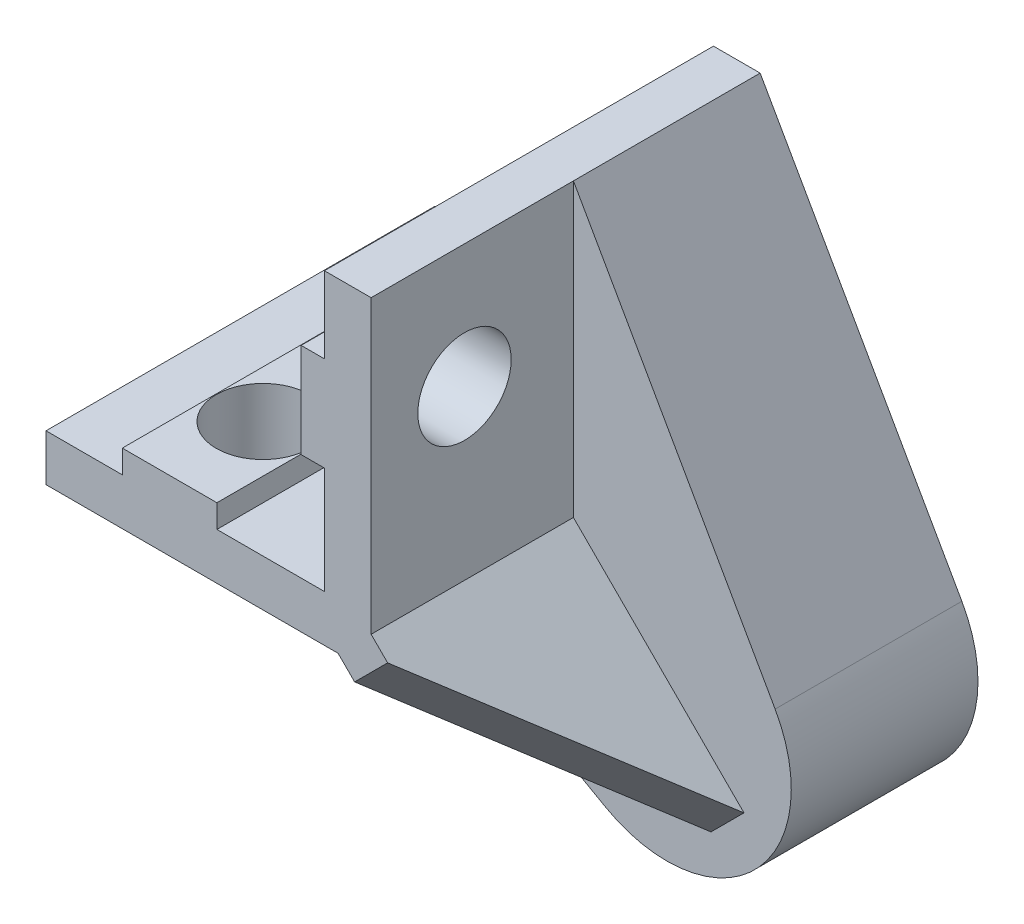
ISO-10303-21;
HEADER;
FILE_DESCRIPTION(('STEP AP214'),'2;1');
FILE_NAME('part.step','',(''),(''),'','','');
FILE_SCHEMA(('AUTOMOTIVE_DESIGN { 1 0 10303 214 1 1 1 1 }'));
ENDSEC;
DATA;
#1=APPLICATION_CONTEXT('core data for automotive mechanical design processes');
#2=APPLICATION_PROTOCOL_DEFINITION('international standard','automotive_design',2000,#1);
#3=PRODUCT_CONTEXT('',#1,'mechanical');
#4=PRODUCT('Part','Part','',(#3));
#5=PRODUCT_RELATED_PRODUCT_CATEGORY('part','',(#4));
#6=PRODUCT_DEFINITION_FORMATION('','',#4);
#7=PRODUCT_DEFINITION_CONTEXT('part definition',#1,'design');
#8=PRODUCT_DEFINITION('design','',#6,#7);
#9=PRODUCT_DEFINITION_SHAPE('','',#8);
#10=(LENGTH_UNIT() NAMED_UNIT(*) SI_UNIT(.MILLI.,.METRE.));
#11=(NAMED_UNIT(*) PLANE_ANGLE_UNIT() SI_UNIT($,.RADIAN.));
#12=(NAMED_UNIT(*) SI_UNIT($,.STERADIAN.) SOLID_ANGLE_UNIT());
#13=UNCERTAINTY_MEASURE_WITH_UNIT(LENGTH_MEASURE(1.E-05),#10,'distance_accuracy_value','');
#14=(GEOMETRIC_REPRESENTATION_CONTEXT(3) GLOBAL_UNCERTAINTY_ASSIGNED_CONTEXT((#13)) GLOBAL_UNIT_ASSIGNED_CONTEXT((#10,
#11,#12)) REPRESENTATION_CONTEXT('',''));
#15=CARTESIAN_POINT('',(0.,0.,0.));
#16=DIRECTION('',(0.,0.,1.));
#17=DIRECTION('',(1.,0.,0.));
#18=AXIS2_PLACEMENT_3D('',#15,#16,#17);
#19=CARTESIAN_POINT('',(230.088719843331,41.429550862018,-25.));
#20=DIRECTION('',(1.,0.,0.));
#21=DIRECTION('',(0.,0.,-1.));
#22=AXIS2_PLACEMENT_3D('',#19,#20,#21);
#23=PLANE('',#22);
#24=CARTESIAN_POINT('',(230.088719843331,54.3395711724228,-6.));
#25=DIRECTION('',(1.,0.,0.));
#26=DIRECTION('',(0.,0.,-1.));
#27=AXIS2_PLACEMENT_3D('',#24,#25,#26);
#28=CIRCLE('',#27,3.);
#29=CARTESIAN_POINT('',(230.088719843331,54.3395711724228,-9.));
#30=VERTEX_POINT('',#29);
#31=EDGE_CURVE('E244',#30,#30,#28,.T.);
#32=ORIENTED_EDGE('',*,*,#31,.F.);
#33=EDGE_LOOP('',(#32));
#34=FACE_BOUND('',#33,.T.);
#35=DIRECTION('',(0.,1.,0.));
#36=VECTOR('',#35,1.);
#37=CARTESIAN_POINT('',(230.088719843331,41.429550862018,0.));
#38=LINE('',#37,#36);
#39=CARTESIAN_POINT('',(230.088719843331,43.5504865618595,0.));
#40=VERTEX_POINT('',#39);
#41=CARTESIAN_POINT('',(230.088719843331,62.2829711724228,0.));
#42=VERTEX_POINT('',#41);
#43=EDGE_CURVE('E51',#40,#42,#38,.T.);
#44=ORIENTED_EDGE('',*,*,#43,.F.);
#45=DIRECTION('',(0.,0.,-1.));
#46=VECTOR('',#45,1.);
#47=CARTESIAN_POINT('',(230.088719843331,43.5504865618595,-25.));
#48=LINE('',#47,#46);
#49=CARTESIAN_POINT('',(230.088719843331,43.5504865618595,-13.));
#50=VERTEX_POINT('',#49);
#51=EDGE_CURVE('E210',#40,#50,#48,.T.);
#52=ORIENTED_EDGE('',*,*,#51,.T.);
#53=DIRECTION('',(0.,1.,0.));
#54=VECTOR('',#53,1.);
#55=CARTESIAN_POINT('',(230.088719843331,41.429550862018,-13.));
#56=LINE('',#55,#54);
#57=CARTESIAN_POINT('',(230.088719843331,62.2829711724228,-13.));
#58=VERTEX_POINT('',#57);
#59=EDGE_CURVE('E214',#50,#58,#56,.T.);
#60=ORIENTED_EDGE('',*,*,#59,.T.);
#61=DIRECTION('',(0.,0.,1.));
#62=VECTOR('',#61,1.);
#63=CARTESIAN_POINT('',(230.088719843331,62.2829711724228,-25.));
#64=LINE('',#63,#62);
#65=EDGE_CURVE('E326',#58,#42,#64,.T.);
#66=ORIENTED_EDGE('',*,*,#65,.T.);
#67=EDGE_LOOP('',(#44,#52,#60,#66));
#68=FACE_BOUND('',#67,.T.);
#69=ADVANCED_FACE('F36',(#34,#68),#23,.T.);
#70=CARTESIAN_POINT('',(209.195275179556,41.429550862018,-25.));
#71=DIRECTION('',(0.,-1.,0.));
#72=DIRECTION('',(0.,0.,-1.));
#73=AXIS2_PLACEMENT_3D('',#70,#71,#72);
#74=PLANE('',#73);
#75=DIRECTION('',(0.,0.,-1.));
#76=VECTOR('',#75,1.);
#77=CARTESIAN_POINT('',(227.967014646705,41.429550862018,-25.));
#78=LINE('',#77,#76);
#79=CARTESIAN_POINT('',(227.967014646705,41.429550862018,0.));
#80=VERTEX_POINT('',#79);
#81=CARTESIAN_POINT('',(227.967014646705,41.429550862018,-13.));
#82=VERTEX_POINT('',#81);
#83=EDGE_CURVE('E59',#80,#82,#78,.T.);
#84=ORIENTED_EDGE('',*,*,#83,.F.);
#85=DIRECTION('',(1.,0.,0.));
#86=VECTOR('',#85,1.);
#87=CARTESIAN_POINT('',(209.195275179556,41.429550862018,0.));
#88=LINE('',#87,#86);
#89=CARTESIAN_POINT('',(209.195275179556,41.429550862018,0.));
#90=VERTEX_POINT('',#89);
#91=EDGE_CURVE('E199',#90,#80,#88,.T.);
#92=ORIENTED_EDGE('',*,*,#91,.F.);
#93=DIRECTION('',(0.,0.,1.));
#94=VECTOR('',#93,1.);
#95=CARTESIAN_POINT('',(209.195275179556,41.429550862018,-25.));
#96=LINE('',#95,#94);
#97=CARTESIAN_POINT('',(209.195275179556,41.429550862018,-13.));
#98=VERTEX_POINT('',#97);
#99=EDGE_CURVE('E330',#98,#90,#96,.T.);
#100=ORIENTED_EDGE('',*,*,#99,.F.);
#101=DIRECTION('',(1.,0.,0.));
#102=VECTOR('',#101,1.);
#103=CARTESIAN_POINT('',(209.195275179556,41.429550862018,-13.));
#104=LINE('',#103,#102);
#105=EDGE_CURVE('E226',#98,#82,#104,.T.);
#106=ORIENTED_EDGE('',*,*,#105,.T.);
#107=EDGE_LOOP('',(#84,#92,#100,#106));
#108=FACE_BOUND('',#107,.T.);
#109=CARTESIAN_POINT('',(217.138695007103,41.429550862018,-6.));
#110=DIRECTION('',(0.,-1.,0.));
#111=DIRECTION('',(0.,0.,-1.));
#112=AXIS2_PLACEMENT_3D('',#109,#110,#111);
#113=CIRCLE('',#112,2.99999999999999);
#114=CARTESIAN_POINT('',(217.138695007103,41.429550862018,-8.99999999999999));
#115=VERTEX_POINT('',#114);
#116=EDGE_CURVE('E239',#115,#115,#113,.T.);
#117=ORIENTED_EDGE('',*,*,#116,.F.);
#118=EDGE_LOOP('',(#117));
#119=FACE_BOUND('',#118,.T.);
#120=ADVANCED_FACE('F365',(#108,#119),#74,.T.);
#121=CARTESIAN_POINT('',(230.088719843331,62.2829711724228,-25.));
#122=DIRECTION('',(0.,1.,0.));
#123=DIRECTION('',(-1.,0.,0.));
#124=AXIS2_PLACEMENT_3D('',#121,#122,#123);
#125=PLANE('',#124);
#126=DIRECTION('',(-1.,0.,0.));
#127=VECTOR('',#126,1.);
#128=CARTESIAN_POINT('',(230.088719843331,62.2829711724228,0.));
#129=LINE('',#128,#127);
#130=CARTESIAN_POINT('',(227.088719843331,62.2829711724228,0.));
#131=VERTEX_POINT('',#130);
#132=EDGE_CURVE('E286',#42,#131,#129,.T.);
#133=ORIENTED_EDGE('',*,*,#132,.F.);
#134=ORIENTED_EDGE('',*,*,#65,.F.);
#135=CARTESIAN_POINT('',(230.088719843331,62.2829711724228,-25.));
#136=VERTEX_POINT('',#135);
#137=EDGE_CURVE('E322',#136,#58,#64,.T.);
#138=ORIENTED_EDGE('',*,*,#137,.F.);
#139=DIRECTION('',(-1.,0.,0.));
#140=VECTOR('',#139,1.);
#141=CARTESIAN_POINT('',(230.088719843331,62.2829711724228,-25.));
#142=LINE('',#141,#140);
#143=CARTESIAN_POINT('',(227.088719843331,62.2829711724228,-25.));
#144=VERTEX_POINT('',#143);
#145=EDGE_CURVE('E248',#136,#144,#142,.T.);
#146=ORIENTED_EDGE('',*,*,#145,.T.);
#147=DIRECTION('',(0.,0.,1.));
#148=VECTOR('',#147,1.);
#149=CARTESIAN_POINT('',(227.088719843331,62.2829711724228,-25.));
#150=LINE('',#149,#148);
#151=EDGE_CURVE('E285',#144,#131,#150,.T.);
#152=ORIENTED_EDGE('',*,*,#151,.T.);
#153=EDGE_LOOP('',(#133,#134,#138,#146,#152));
#154=FACE_BOUND('',#153,.T.);
#155=ADVANCED_FACE('F38',(#154),#125,.T.);
#156=CARTESIAN_POINT('',(209.195275179556,44.429550862018,-25.));
#157=DIRECTION('',(-1.,0.,0.));
#158=DIRECTION('',(0.,-1.,0.));
#159=AXIS2_PLACEMENT_3D('',#156,#157,#158);
#160=PLANE('',#159);
#161=DIRECTION('',(0.,-1.,0.));
#162=VECTOR('',#161,1.);
#163=CARTESIAN_POINT('',(209.195275179556,44.429550862018,0.));
#164=LINE('',#163,#162);
#165=CARTESIAN_POINT('',(209.195275179556,44.429550862018,0.));
#166=VERTEX_POINT('',#165);
#167=EDGE_CURVE('E318',#166,#90,#164,.T.);
#168=ORIENTED_EDGE('',*,*,#167,.F.);
#169=DIRECTION('',(0.,0.,1.));
#170=VECTOR('',#169,1.);
#171=CARTESIAN_POINT('',(209.195275179556,44.429550862018,-25.));
#172=LINE('',#171,#170);
#173=CARTESIAN_POINT('',(209.195275179556,44.429550862018,-25.));
#174=VERTEX_POINT('',#173);
#175=EDGE_CURVE('E331',#174,#166,#172,.T.);
#176=ORIENTED_EDGE('',*,*,#175,.F.);
#177=DIRECTION('',(0.,-1.,0.));
#178=VECTOR('',#177,1.);
#179=CARTESIAN_POINT('',(209.195275179556,44.429550862018,-25.));
#180=LINE('',#179,#178);
#181=CARTESIAN_POINT('',(209.195275179556,41.429550862018,-25.));
#182=VERTEX_POINT('',#181);
#183=EDGE_CURVE('E283',#174,#182,#180,.T.);
#184=ORIENTED_EDGE('',*,*,#183,.T.);
#185=EDGE_CURVE('E327',#182,#98,#96,.T.);
#186=ORIENTED_EDGE('',*,*,#185,.T.);
#187=ORIENTED_EDGE('',*,*,#99,.T.);
#188=EDGE_LOOP('',(#168,#176,#184,#186,#187));
#189=FACE_BOUND('',#188,.T.);
#190=ADVANCED_FACE('F376',(#189),#160,.T.);
#191=CARTESIAN_POINT('',(214.098687418949,44.429550862018,-25.));
#192=DIRECTION('',(0.,1.,0.));
#193=DIRECTION('',(-1.,0.,0.));
#194=AXIS2_PLACEMENT_3D('',#191,#192,#193);
#195=PLANE('',#194);
#196=DIRECTION('',(-1.,0.,0.));
#197=VECTOR('',#196,1.);
#198=CARTESIAN_POINT('',(214.098687418949,44.429550862018,0.));
#199=LINE('',#198,#197);
#200=CARTESIAN_POINT('',(214.098687418949,44.429550862018,0.));
#201=VERTEX_POINT('',#200);
#202=EDGE_CURVE('E315',#201,#166,#199,.T.);
#203=ORIENTED_EDGE('',*,*,#202,.F.);
#204=DIRECTION('',(0.,0.,1.));
#205=VECTOR('',#204,1.);
#206=CARTESIAN_POINT('',(214.098687418949,44.429550862018,-25.));
#207=LINE('',#206,#205);
#208=CARTESIAN_POINT('',(214.098687418949,44.429550862018,-25.));
#209=VERTEX_POINT('',#208);
#210=EDGE_CURVE('E333',#209,#201,#207,.T.);
#211=ORIENTED_EDGE('',*,*,#210,.F.);
#212=DIRECTION('',(-1.,0.,0.));
#213=VECTOR('',#212,1.);
#214=CARTESIAN_POINT('',(214.098687418949,44.429550862018,-25.));
#215=LINE('',#214,#213);
#216=EDGE_CURVE('E280',#209,#174,#215,.T.);
#217=ORIENTED_EDGE('',*,*,#216,.T.);
#218=ORIENTED_EDGE('',*,*,#175,.T.);
#219=EDGE_LOOP('',(#203,#211,#217,#218));
#220=FACE_BOUND('',#219,.T.);
#221=ADVANCED_FACE('F379',(#220),#195,.T.);
#222=CARTESIAN_POINT('',(214.098687418949,45.9171950677049,-25.));
#223=DIRECTION('',(-1.,0.,0.));
#224=DIRECTION('',(0.,0.,1.));
#225=AXIS2_PLACEMENT_3D('',#222,#223,#224);
#226=PLANE('',#225);
#227=DIRECTION('',(0.,-1.,0.));
#228=VECTOR('',#227,1.);
#229=CARTESIAN_POINT('',(214.098687418949,45.9171950677049,0.));
#230=LINE('',#229,#228);
#231=CARTESIAN_POINT('',(214.098687418949,45.9171950677049,0.));
#232=VERTEX_POINT('',#231);
#233=EDGE_CURVE('E312',#232,#201,#230,.T.);
#234=ORIENTED_EDGE('',*,*,#233,.F.);
#235=DIRECTION('',(0.,0.,1.));
#236=VECTOR('',#235,1.);
#237=CARTESIAN_POINT('',(214.098687418949,45.9171950677049,-25.));
#238=LINE('',#237,#236);
#239=CARTESIAN_POINT('',(214.098687418949,45.9171950677049,-25.));
#240=VERTEX_POINT('',#239);
#241=EDGE_CURVE('E335',#240,#232,#238,.T.);
#242=ORIENTED_EDGE('',*,*,#241,.F.);
#243=DIRECTION('',(0.,-1.,0.));
#244=VECTOR('',#243,1.);
#245=CARTESIAN_POINT('',(214.098687418949,45.9171950677049,-25.));
#246=LINE('',#245,#244);
#247=EDGE_CURVE('E277',#240,#209,#246,.T.);
#248=ORIENTED_EDGE('',*,*,#247,.T.);
#249=ORIENTED_EDGE('',*,*,#210,.T.);
#250=EDGE_LOOP('',(#234,#242,#248,#249));
#251=FACE_BOUND('',#250,.T.);
#252=ADVANCED_FACE('F383',(#251),#226,.T.);
#253=CARTESIAN_POINT('',(220.178702595257,45.9171950677049,-25.));
#254=DIRECTION('',(0.,1.,0.));
#255=DIRECTION('',(0.,0.,1.));
#256=AXIS2_PLACEMENT_3D('',#253,#254,#255);
#257=PLANE('',#256);
#258=CARTESIAN_POINT('',(217.138695007103,45.9171950677049,-6.));
#259=DIRECTION('',(0.,1.,0.));
#260=DIRECTION('',(0.,0.,1.));
#261=AXIS2_PLACEMENT_3D('',#258,#259,#260);
#262=CIRCLE('',#261,2.99999999999999);
#263=CARTESIAN_POINT('',(217.138695007103,45.9171950677049,-3.00000000000001));
#264=VERTEX_POINT('',#263);
#265=EDGE_CURVE('E243',#264,#264,#262,.T.);
#266=ORIENTED_EDGE('',*,*,#265,.F.);
#267=EDGE_LOOP('',(#266));
#268=FACE_BOUND('',#267,.T.);
#269=DIRECTION('',(-1.,0.,0.));
#270=VECTOR('',#269,1.);
#271=CARTESIAN_POINT('',(220.178702595257,45.9171950677049,0.));
#272=LINE('',#271,#270);
#273=CARTESIAN_POINT('',(220.178702595257,45.9171950677049,0.));
#274=VERTEX_POINT('',#273);
#275=EDGE_CURVE('E309',#274,#232,#272,.T.);
#276=ORIENTED_EDGE('',*,*,#275,.F.);
#277=DIRECTION('',(0.,0.,1.));
#278=VECTOR('',#277,1.);
#279=CARTESIAN_POINT('',(220.178702595257,45.9171950677049,-25.));
#280=LINE('',#279,#278);
#281=CARTESIAN_POINT('',(220.178702595257,45.9171950677049,-25.));
#282=VERTEX_POINT('',#281);
#283=EDGE_CURVE('E337',#282,#274,#280,.T.);
#284=ORIENTED_EDGE('',*,*,#283,.F.);
#285=DIRECTION('',(-1.,0.,0.));
#286=VECTOR('',#285,1.);
#287=CARTESIAN_POINT('',(220.178702595257,45.9171950677049,-25.));
#288=LINE('',#287,#286);
#289=EDGE_CURVE('E274',#282,#240,#288,.T.);
#290=ORIENTED_EDGE('',*,*,#289,.T.);
#291=ORIENTED_EDGE('',*,*,#241,.T.);
#292=EDGE_LOOP('',(#276,#284,#290,#291));
#293=FACE_BOUND('',#292,.T.);
#294=ADVANCED_FACE('F387',(#268,#293),#257,.T.);
#295=CARTESIAN_POINT('',(220.178702595257,45.9171950677049,-25.));
#296=DIRECTION('',(1.,0.,0.));
#297=DIRECTION('',(0.,1.,0.));
#298=AXIS2_PLACEMENT_3D('',#295,#296,#297);
#299=PLANE('',#298);
#300=DIRECTION('',(0.,1.,0.));
#301=VECTOR('',#300,1.);
#302=CARTESIAN_POINT('',(220.178702595257,45.9171950677049,0.));
#303=LINE('',#302,#301);
#304=CARTESIAN_POINT('',(220.178702595257,44.429550862018,0.));
#305=VERTEX_POINT('',#304);
#306=EDGE_CURVE('E306',#305,#274,#303,.T.);
#307=ORIENTED_EDGE('',*,*,#306,.F.);
#308=DIRECTION('',(0.,0.,1.));
#309=VECTOR('',#308,1.);
#310=CARTESIAN_POINT('',(220.178702595257,44.429550862018,-25.));
#311=LINE('',#310,#309);
#312=CARTESIAN_POINT('',(220.178702595257,44.429550862018,-25.));
#313=VERTEX_POINT('',#312);
#314=EDGE_CURVE('E339',#313,#305,#311,.T.);
#315=ORIENTED_EDGE('',*,*,#314,.F.);
#316=DIRECTION('',(0.,1.,0.));
#317=VECTOR('',#316,1.);
#318=CARTESIAN_POINT('',(220.178702595257,45.9171950677049,-25.));
#319=LINE('',#318,#317);
#320=EDGE_CURVE('E271',#313,#282,#319,.T.);
#321=ORIENTED_EDGE('',*,*,#320,.T.);
#322=ORIENTED_EDGE('',*,*,#283,.T.);
#323=EDGE_LOOP('',(#307,#315,#321,#322));
#324=FACE_BOUND('',#323,.T.);
#325=ADVANCED_FACE('F391',(#324),#299,.T.);
#326=CARTESIAN_POINT('',(227.088719843331,44.429550862018,-25.));
#327=DIRECTION('',(0.,1.,0.));
#328=DIRECTION('',(0.,0.,1.));
#329=AXIS2_PLACEMENT_3D('',#326,#327,#328);
#330=PLANE('',#329);
#331=DIRECTION('',(-1.,0.,0.));
#332=VECTOR('',#331,1.);
#333=CARTESIAN_POINT('',(227.088719843331,44.429550862018,0.));
#334=LINE('',#333,#332);
#335=CARTESIAN_POINT('',(227.088719843331,44.429550862018,0.));
#336=VERTEX_POINT('',#335);
#337=EDGE_CURVE('E303',#336,#305,#334,.T.);
#338=ORIENTED_EDGE('',*,*,#337,.F.);
#339=DIRECTION('',(0.,0.,1.));
#340=VECTOR('',#339,1.);
#341=CARTESIAN_POINT('',(227.088719843331,44.429550862018,-25.));
#342=LINE('',#341,#340);
#343=CARTESIAN_POINT('',(227.088719843331,44.429550862018,-25.));
#344=VERTEX_POINT('',#343);
#345=EDGE_CURVE('E341',#344,#336,#342,.T.);
#346=ORIENTED_EDGE('',*,*,#345,.F.);
#347=DIRECTION('',(-1.,0.,0.));
#348=VECTOR('',#347,1.);
#349=CARTESIAN_POINT('',(227.088719843331,44.429550862018,-25.));
#350=LINE('',#349,#348);
#351=EDGE_CURVE('E268',#344,#313,#350,.T.);
#352=ORIENTED_EDGE('',*,*,#351,.T.);
#353=ORIENTED_EDGE('',*,*,#314,.T.);
#354=EDGE_LOOP('',(#338,#346,#352,#353));
#355=FACE_BOUND('',#354,.T.);
#356=ADVANCED_FACE('F395',(#355),#330,.T.);
#357=CARTESIAN_POINT('',(227.088719843331,51.2995711724228,-25.));
#358=DIRECTION('',(-1.,0.,0.));
#359=DIRECTION('',(0.,0.,1.));
#360=AXIS2_PLACEMENT_3D('',#357,#358,#359);
#361=PLANE('',#360);
#362=DIRECTION('',(0.,-1.,0.));
#363=VECTOR('',#362,1.);
#364=CARTESIAN_POINT('',(227.088719843331,51.2995711724228,0.));
#365=LINE('',#364,#363);
#366=CARTESIAN_POINT('',(227.088719843331,51.2995711724228,0.));
#367=VERTEX_POINT('',#366);
#368=EDGE_CURVE('E301',#367,#336,#365,.T.);
#369=ORIENTED_EDGE('',*,*,#368,.F.);
#370=DIRECTION('',(0.,0.,1.));
#371=VECTOR('',#370,1.);
#372=CARTESIAN_POINT('',(227.088719843331,51.2995711724228,-25.));
#373=LINE('',#372,#371);
#374=CARTESIAN_POINT('',(227.088719843331,51.2995711724228,-25.));
#375=VERTEX_POINT('',#374);
#376=EDGE_CURVE('E343',#375,#367,#373,.T.);
#377=ORIENTED_EDGE('',*,*,#376,.F.);
#378=DIRECTION('',(0.,-1.,0.));
#379=VECTOR('',#378,1.);
#380=CARTESIAN_POINT('',(227.088719843331,51.2995711724228,-25.));
#381=LINE('',#380,#379);
#382=EDGE_CURVE('E265',#375,#344,#381,.T.);
#383=ORIENTED_EDGE('',*,*,#382,.T.);
#384=ORIENTED_EDGE('',*,*,#345,.T.);
#385=EDGE_LOOP('',(#369,#377,#383,#384));
#386=FACE_BOUND('',#385,.T.);
#387=ADVANCED_FACE('F399',(#386),#361,.T.);
#388=CARTESIAN_POINT('',(225.590119843331,51.2995711724228,-25.));
#389=DIRECTION('',(0.,-1.,0.));
#390=DIRECTION('',(0.,0.,-1.));
#391=AXIS2_PLACEMENT_3D('',#388,#389,#390);
#392=PLANE('',#391);
#393=DIRECTION('',(1.,0.,0.));
#394=VECTOR('',#393,1.);
#395=CARTESIAN_POINT('',(225.590119843331,51.2995711724228,0.));
#396=LINE('',#395,#394);
#397=CARTESIAN_POINT('',(225.590119843331,51.2995711724228,0.));
#398=VERTEX_POINT('',#397);
#399=EDGE_CURVE('E298',#398,#367,#396,.T.);
#400=ORIENTED_EDGE('',*,*,#399,.F.);
#401=DIRECTION('',(0.,0.,1.));
#402=VECTOR('',#401,1.);
#403=CARTESIAN_POINT('',(225.590119843331,51.2995711724228,-25.));
#404=LINE('',#403,#402);
#405=CARTESIAN_POINT('',(225.590119843331,51.2995711724228,-25.));
#406=VERTEX_POINT('',#405);
#407=EDGE_CURVE('E345',#406,#398,#404,.T.);
#408=ORIENTED_EDGE('',*,*,#407,.F.);
#409=DIRECTION('',(1.,0.,0.));
#410=VECTOR('',#409,1.);
#411=CARTESIAN_POINT('',(225.590119843331,51.2995711724228,-25.));
#412=LINE('',#411,#410);
#413=EDGE_CURVE('E262',#406,#375,#412,.T.);
#414=ORIENTED_EDGE('',*,*,#413,.T.);
#415=ORIENTED_EDGE('',*,*,#376,.T.);
#416=EDGE_LOOP('',(#400,#408,#414,#415));
#417=FACE_BOUND('',#416,.T.);
#418=ADVANCED_FACE('F403',(#417),#392,.T.);
#419=CARTESIAN_POINT('',(225.590119843331,51.2995711724228,-25.));
#420=DIRECTION('',(-1.,0.,0.));
#421=DIRECTION('',(0.,0.,1.));
#422=AXIS2_PLACEMENT_3D('',#419,#420,#421);
#423=PLANE('',#422);
#424=CARTESIAN_POINT('',(225.590119843331,54.3395711724228,-6.));
#425=DIRECTION('',(-1.,0.,0.));
#426=DIRECTION('',(0.,0.,1.));
#427=AXIS2_PLACEMENT_3D('',#424,#425,#426);
#428=CIRCLE('',#427,3.);
#429=CARTESIAN_POINT('',(225.590119843331,54.3395711724228,-3.));
#430=VERTEX_POINT('',#429);
#431=EDGE_CURVE('E247',#430,#430,#428,.T.);
#432=ORIENTED_EDGE('',*,*,#431,.F.);
#433=EDGE_LOOP('',(#432));
#434=FACE_BOUND('',#433,.T.);
#435=DIRECTION('',(0.,-1.,0.));
#436=VECTOR('',#435,1.);
#437=CARTESIAN_POINT('',(225.590119843331,51.2995711724228,0.));
#438=LINE('',#437,#436);
#439=CARTESIAN_POINT('',(225.590119843331,57.3795711724228,0.));
#440=VERTEX_POINT('',#439);
#441=EDGE_CURVE('E295',#440,#398,#438,.T.);
#442=ORIENTED_EDGE('',*,*,#441,.F.);
#443=DIRECTION('',(0.,0.,1.));
#444=VECTOR('',#443,1.);
#445=CARTESIAN_POINT('',(225.590119843331,57.3795711724228,-25.));
#446=LINE('',#445,#444);
#447=CARTESIAN_POINT('',(225.590119843331,57.3795711724228,-25.));
#448=VERTEX_POINT('',#447);
#449=EDGE_CURVE('E347',#448,#440,#446,.T.);
#450=ORIENTED_EDGE('',*,*,#449,.F.);
#451=DIRECTION('',(0.,-1.,0.));
#452=VECTOR('',#451,1.);
#453=CARTESIAN_POINT('',(225.590119843331,51.2995711724228,-25.));
#454=LINE('',#453,#452);
#455=EDGE_CURVE('E259',#448,#406,#454,.T.);
#456=ORIENTED_EDGE('',*,*,#455,.T.);
#457=ORIENTED_EDGE('',*,*,#407,.T.);
#458=EDGE_LOOP('',(#442,#450,#456,#457));
#459=FACE_BOUND('',#458,.T.);
#460=ADVANCED_FACE('F407',(#434,#459),#423,.T.);
#461=CARTESIAN_POINT('',(225.590119843331,57.3795711724228,-25.));
#462=DIRECTION('',(0.,1.,0.));
#463=DIRECTION('',(0.,0.,1.));
#464=AXIS2_PLACEMENT_3D('',#461,#462,#463);
#465=PLANE('',#464);
#466=DIRECTION('',(-1.,0.,0.));
#467=VECTOR('',#466,1.);
#468=CARTESIAN_POINT('',(225.590119843331,57.3795711724228,0.));
#469=LINE('',#468,#467);
#470=CARTESIAN_POINT('',(227.088719843331,57.3795711724228,0.));
#471=VERTEX_POINT('',#470);
#472=EDGE_CURVE('E292',#471,#440,#469,.T.);
#473=ORIENTED_EDGE('',*,*,#472,.F.);
#474=DIRECTION('',(0.,0.,1.));
#475=VECTOR('',#474,1.);
#476=CARTESIAN_POINT('',(227.088719843331,57.3795711724228,-25.));
#477=LINE('',#476,#475);
#478=CARTESIAN_POINT('',(227.088719843331,57.3795711724228,-25.));
#479=VERTEX_POINT('',#478);
#480=EDGE_CURVE('E349',#479,#471,#477,.T.);
#481=ORIENTED_EDGE('',*,*,#480,.F.);
#482=DIRECTION('',(-1.,0.,0.));
#483=VECTOR('',#482,1.);
#484=CARTESIAN_POINT('',(225.590119843331,57.3795711724228,-25.));
#485=LINE('',#484,#483);
#486=EDGE_CURVE('E256',#479,#448,#485,.T.);
#487=ORIENTED_EDGE('',*,*,#486,.T.);
#488=ORIENTED_EDGE('',*,*,#449,.T.);
#489=EDGE_LOOP('',(#473,#481,#487,#488));
#490=FACE_BOUND('',#489,.T.);
#491=ADVANCED_FACE('F411',(#490),#465,.T.);
#492=CARTESIAN_POINT('',(227.088719843331,62.2829711724228,-25.));
#493=DIRECTION('',(-1.,0.,0.));
#494=DIRECTION('',(0.,0.,1.));
#495=AXIS2_PLACEMENT_3D('',#492,#493,#494);
#496=PLANE('',#495);
#497=DIRECTION('',(0.,-1.,0.));
#498=VECTOR('',#497,1.);
#499=CARTESIAN_POINT('',(227.088719843331,62.2829711724228,0.));
#500=LINE('',#499,#498);
#501=EDGE_CURVE('E289',#131,#471,#500,.T.);
#502=ORIENTED_EDGE('',*,*,#501,.F.);
#503=ORIENTED_EDGE('',*,*,#151,.F.);
#504=DIRECTION('',(0.,-1.,0.));
#505=VECTOR('',#504,1.);
#506=CARTESIAN_POINT('',(227.088719843331,62.2829711724228,-25.));
#507=LINE('',#506,#505);
#508=EDGE_CURVE('E252',#144,#479,#507,.T.);
#509=ORIENTED_EDGE('',*,*,#508,.T.);
#510=ORIENTED_EDGE('',*,*,#480,.T.);
#511=EDGE_LOOP('',(#502,#503,#509,#510));
#512=FACE_BOUND('',#511,.T.);
#513=ADVANCED_FACE('F414',(#512),#496,.T.);
#514=CARTESIAN_POINT('',(227.088719843331,62.2829711724228,-25.));
#515=DIRECTION('',(0.,0.,1.));
#516=DIRECTION('',(1.,0.,0.));
#517=AXIS2_PLACEMENT_3D('',#514,#515,#516);
#518=PLANE('',#517);
#519=CARTESIAN_POINT('',(236.088719843331,35.429550862018,-25.));
#520=DIRECTION('',(0.,0.,-1.));
#521=DIRECTION('',(-1.,0.,0.));
#522=AXIS2_PLACEMENT_3D('',#519,#520,#521);
#523=CIRCLE('',#522,4.85);
#524=CARTESIAN_POINT('',(231.238719843331,35.429550862018,-25.));
#525=VERTEX_POINT('',#524);
#526=EDGE_CURVE('E204',#525,#525,#523,.T.);
#527=ORIENTED_EDGE('',*,*,#526,.F.);
#528=EDGE_LOOP('',(#527));
#529=FACE_BOUND('',#528,.T.);
#530=ORIENTED_EDGE('',*,*,#145,.F.);
#531=DIRECTION('',(0.492386444964681,-0.870376693630432,0.));
#532=VECTOR('',#531,1.);
#533=CARTESIAN_POINT('',(230.088719843331,62.2829711724228,-25.));
#534=LINE('',#533,#532);
#535=CARTESIAN_POINT('',(243.051733392374,39.3686424217354,-25.));
#536=VERTEX_POINT('',#535);
#537=EDGE_CURVE('E213',#136,#536,#534,.T.);
#538=ORIENTED_EDGE('',*,*,#537,.T.);
#539=CARTESIAN_POINT('',(236.088719843331,35.429550862018,-25.));
#540=DIRECTION('',(0.,0.,-1.));
#541=DIRECTION('',(-1.,0.,0.));
#542=AXIS2_PLACEMENT_3D('',#539,#540,#541);
#543=CIRCLE('',#542,8.00000000000001);
#544=CARTESIAN_POINT('',(232.154834184776,28.4635948166917,-25.));
#545=VERTEX_POINT('',#544);
#546=EDGE_CURVE('E232',#536,#545,#543,.T.);
#547=ORIENTED_EDGE('',*,*,#546,.T.);
#548=DIRECTION('',(-0.870744505665787,0.491735707319333,0.));
#549=VECTOR('',#548,1.);
#550=CARTESIAN_POINT('',(232.154834184776,28.4635948166917,-25.));
#551=LINE('',#550,#549);
#552=EDGE_CURVE('E217',#545,#182,#551,.T.);
#553=ORIENTED_EDGE('',*,*,#552,.T.);
#554=ORIENTED_EDGE('',*,*,#183,.F.);
#555=ORIENTED_EDGE('',*,*,#216,.F.);
#556=ORIENTED_EDGE('',*,*,#247,.F.);
#557=ORIENTED_EDGE('',*,*,#289,.F.);
#558=ORIENTED_EDGE('',*,*,#320,.F.);
#559=ORIENTED_EDGE('',*,*,#351,.F.);
#560=ORIENTED_EDGE('',*,*,#382,.F.);
#561=ORIENTED_EDGE('',*,*,#413,.F.);
#562=ORIENTED_EDGE('',*,*,#455,.F.);
#563=ORIENTED_EDGE('',*,*,#486,.F.);
#564=ORIENTED_EDGE('',*,*,#508,.F.);
#565=EDGE_LOOP('',(#530,#538,#547,#553,#554,#555,#556,#557,#558,#559,#560,#561,#562,#563,#564));
#566=FACE_BOUND('',#565,.T.);
#567=ADVANCED_FACE('F417',(#529,#566),#518,.F.);
#568=CARTESIAN_POINT('',(227.088719843331,62.2829711724228,0.));
#569=DIRECTION('',(0.,0.,1.));
#570=DIRECTION('',(1.,0.,0.));
#571=AXIS2_PLACEMENT_3D('',#568,#569,#570);
#572=PLANE('',#571);
#573=ORIENTED_EDGE('',*,*,#368,.T.);
#574=ORIENTED_EDGE('',*,*,#337,.T.);
#575=ORIENTED_EDGE('',*,*,#306,.T.);
#576=ORIENTED_EDGE('',*,*,#275,.T.);
#577=ORIENTED_EDGE('',*,*,#233,.T.);
#578=ORIENTED_EDGE('',*,*,#202,.T.);
#579=ORIENTED_EDGE('',*,*,#167,.T.);
#580=ORIENTED_EDGE('',*,*,#91,.T.);
#581=DIRECTION('',(-0.707235019011738,0.706978520100481,0.));
#582=VECTOR('',#581,1.);
#583=CARTESIAN_POINT('',(229.02825206318,40.3686983335004,0.));
#584=LINE('',#583,#582);
#585=CARTESIAN_POINT('',(229.02825206318,40.3686983335004,0.));
#586=VERTEX_POINT('',#585);
#587=EDGE_CURVE('E194',#586,#80,#584,.T.);
#588=ORIENTED_EDGE('',*,*,#587,.F.);
#589=DIRECTION('',(0.706978520100479,0.707235019011741,0.));
#590=VECTOR('',#589,1.);
#591=CARTESIAN_POINT('',(229.02825206318,40.3686983335004,0.));
#592=LINE('',#591,#590);
#593=CARTESIAN_POINT('',(231.149187623482,42.4904033905356,0.));
#594=VERTEX_POINT('',#593);
#595=EDGE_CURVE('E177',#586,#594,#592,.T.);
#596=ORIENTED_EDGE('',*,*,#595,.T.);
#597=DIRECTION('',(-0.707235019011738,0.706978520100481,0.));
#598=VECTOR('',#597,1.);
#599=CARTESIAN_POINT('',(231.149187623482,42.4904033905356,0.));
#600=LINE('',#599,#598);
#601=EDGE_CURVE('E201',#594,#40,#600,.T.);
#602=ORIENTED_EDGE('',*,*,#601,.T.);
#603=ORIENTED_EDGE('',*,*,#43,.T.);
#604=ORIENTED_EDGE('',*,*,#132,.T.);
#605=ORIENTED_EDGE('',*,*,#501,.T.);
#606=ORIENTED_EDGE('',*,*,#472,.T.);
#607=ORIENTED_EDGE('',*,*,#441,.T.);
#608=ORIENTED_EDGE('',*,*,#399,.T.);
#609=EDGE_LOOP('',(#573,#574,#575,#576,#577,#578,#579,#580,#588,#596,#602,#603,#604,#605,#606,
#607,#608));
#610=FACE_BOUND('',#609,.T.);
#611=ADVANCED_FACE('F197',(#610),#572,.T.);
#612=CARTESIAN_POINT('',(215.088719843331,54.3395711724228,-6.));
#613=DIRECTION('',(1.,0.,0.));
#614=DIRECTION('',(0.,0.,-1.));
#615=AXIS2_PLACEMENT_3D('',#612,#613,#614);
#616=CYLINDRICAL_SURFACE('',#615,3.);
#617=ORIENTED_EDGE('',*,*,#431,.T.);
#618=EDGE_LOOP('',(#617));
#619=FACE_BOUND('',#618,.T.);
#620=ORIENTED_EDGE('',*,*,#31,.T.);
#621=EDGE_LOOP('',(#620));
#622=FACE_BOUND('',#621,.T.);
#623=ADVANCED_FACE('F468',(#619,#622),#616,.F.);
#624=CARTESIAN_POINT('',(217.138695007103,56.429550862018,-6.));
#625=DIRECTION('',(0.,-1.,0.));
#626=DIRECTION('',(0.,0.,-1.));
#627=AXIS2_PLACEMENT_3D('',#624,#625,#626);
#628=CYLINDRICAL_SURFACE('',#627,2.99999999999999);
#629=ORIENTED_EDGE('',*,*,#265,.T.);
#630=EDGE_LOOP('',(#629));
#631=FACE_BOUND('',#630,.T.);
#632=ORIENTED_EDGE('',*,*,#116,.T.);
#633=EDGE_LOOP('',(#632));
#634=FACE_BOUND('',#633,.T.);
#635=ADVANCED_FACE('F466',(#631,#634),#628,.F.);
#636=CARTESIAN_POINT('',(232.154834184776,28.4635948166917,-13.));
#637=DIRECTION('',(-0.491735707319333,-0.870744505665787,0.));
#638=DIRECTION('',(0.870744505665787,-0.491735707319333,0.));
#639=AXIS2_PLACEMENT_3D('',#636,#637,#638);
#640=PLANE('',#639);
#641=ORIENTED_EDGE('',*,*,#552,.F.);
#642=DIRECTION('',(0.,0.,-1.));
#643=VECTOR('',#642,1.);
#644=CARTESIAN_POINT('',(232.154834184776,28.4635948166917,-13.));
#645=LINE('',#644,#643);
#646=CARTESIAN_POINT('',(232.154834184776,28.4635948166917,-13.));
#647=VERTEX_POINT('',#646);
#648=EDGE_CURVE('E237',#647,#545,#645,.T.);
#649=ORIENTED_EDGE('',*,*,#648,.F.);
#650=DIRECTION('',(-0.870744505665787,0.491735707319333,0.));
#651=VECTOR('',#650,1.);
#652=CARTESIAN_POINT('',(232.154834184776,28.4635948166917,-13.));
#653=LINE('',#652,#651);
#654=EDGE_CURVE('E223',#647,#98,#653,.T.);
#655=ORIENTED_EDGE('',*,*,#654,.T.);
#656=ORIENTED_EDGE('',*,*,#185,.F.);
#657=EDGE_LOOP('',(#641,#649,#655,#656));
#658=FACE_BOUND('',#657,.T.);
#659=ADVANCED_FACE('F442',(#658),#640,.T.);
#660=CARTESIAN_POINT('',(236.088719843331,35.429550862018,-13.));
#661=DIRECTION('',(0.,0.,-1.));
#662=DIRECTION('',(-1.,0.,0.));
#663=AXIS2_PLACEMENT_3D('',#660,#661,#662);
#664=CYLINDRICAL_SURFACE('',#663,8.00000000000001);
#665=ORIENTED_EDGE('',*,*,#546,.F.);
#666=DIRECTION('',(0.,0.,-1.));
#667=VECTOR('',#666,1.);
#668=CARTESIAN_POINT('',(243.051733392374,39.3686424217354,-13.));
#669=LINE('',#668,#667);
#670=CARTESIAN_POINT('',(243.051733392374,39.3686424217354,-13.));
#671=VERTEX_POINT('',#670);
#672=EDGE_CURVE('E228',#671,#536,#669,.T.);
#673=ORIENTED_EDGE('',*,*,#672,.F.);
#674=CARTESIAN_POINT('',(236.088719843331,35.429550862018,-13.));
#675=DIRECTION('',(0.,0.,-1.));
#676=DIRECTION('',(-1.,0.,0.));
#677=AXIS2_PLACEMENT_3D('',#674,#675,#676);
#678=CIRCLE('',#677,8.00000000000001);
#679=EDGE_CURVE('E220',#671,#647,#678,.T.);
#680=ORIENTED_EDGE('',*,*,#679,.T.);
#681=ORIENTED_EDGE('',*,*,#648,.T.);
#682=EDGE_LOOP('',(#665,#673,#680,#681));
#683=FACE_BOUND('',#682,.T.);
#684=ADVANCED_FACE('F436',(#683),#664,.T.);
#685=CARTESIAN_POINT('',(230.088719843331,62.2829711724228,-13.));
#686=DIRECTION('',(0.870376693630432,0.492386444964681,0.));
#687=DIRECTION('',(-0.492386444964681,0.870376693630432,0.));
#688=AXIS2_PLACEMENT_3D('',#685,#686,#687);
#689=PLANE('',#688);
#690=ORIENTED_EDGE('',*,*,#537,.F.);
#691=ORIENTED_EDGE('',*,*,#137,.T.);
#692=DIRECTION('',(0.492386444964681,-0.870376693630432,0.));
#693=VECTOR('',#692,1.);
#694=CARTESIAN_POINT('',(230.088719843331,62.2829711724228,-13.));
#695=LINE('',#694,#693);
#696=EDGE_CURVE('E216',#58,#671,#695,.T.);
#697=ORIENTED_EDGE('',*,*,#696,.T.);
#698=ORIENTED_EDGE('',*,*,#672,.T.);
#699=EDGE_LOOP('',(#690,#691,#697,#698));
#700=FACE_BOUND('',#699,.T.);
#701=ADVANCED_FACE('F433',(#700),#689,.T.);
#702=CARTESIAN_POINT('',(236.088719843331,35.429550862018,-13.));
#703=DIRECTION('',(0.,0.,-1.));
#704=DIRECTION('',(-1.,0.,0.));
#705=AXIS2_PLACEMENT_3D('',#702,#703,#704);
#706=PLANE('',#705);
#707=DIRECTION('',(0.706978520100479,0.707235019011741,0.));
#708=VECTOR('',#707,1.);
#709=CARTESIAN_POINT('',(238.929542329345,30.4709990520937,-13.));
#710=LINE('',#709,#708);
#711=CARTESIAN_POINT('',(238.929542329345,30.4709990520937,-13.));
#712=VERTEX_POINT('',#711);
#713=CARTESIAN_POINT('',(241.050477889646,32.5927041091288,-13.));
#714=VERTEX_POINT('',#713);
#715=EDGE_CURVE('E188',#712,#714,#710,.T.);
#716=ORIENTED_EDGE('',*,*,#715,.F.);
#717=DIRECTION('',(-0.707235019011738,0.706978520100481,0.));
#718=VECTOR('',#717,1.);
#719=CARTESIAN_POINT('',(235.029340098504,34.3697867635747,-13.));
#720=LINE('',#719,#718);
#721=EDGE_CURVE('E11',#712,#82,#720,.T.);
#722=ORIENTED_EDGE('',*,*,#721,.T.);
#723=ORIENTED_EDGE('',*,*,#105,.F.);
#724=ORIENTED_EDGE('',*,*,#654,.F.);
#725=ORIENTED_EDGE('',*,*,#679,.F.);
#726=ORIENTED_EDGE('',*,*,#696,.F.);
#727=ORIENTED_EDGE('',*,*,#59,.F.);
#728=DIRECTION('',(-0.707235019011738,0.706978520100481,0.));
#729=VECTOR('',#728,1.);
#730=CARTESIAN_POINT('',(237.150275658806,36.4914918206099,-13.));
#731=LINE('',#730,#729);
#732=EDGE_CURVE('E44',#714,#50,#731,.T.);
#733=ORIENTED_EDGE('',*,*,#732,.F.);
#734=EDGE_LOOP('',(#716,#722,#723,#724,#725,#726,#727,#733));
#735=FACE_BOUND('',#734,.T.);
#736=ADVANCED_FACE('F360',(#735),#706,.F.);
#737=CARTESIAN_POINT('',(238.929542329345,30.4709990520937,-13.));
#738=DIRECTION('',(-0.481238846197576,0.481064311231422,-0.732793491626299));
#739=DIRECTION('',(-0.835868338755599,0.,0.548929977561761));
#740=AXIS2_PLACEMENT_3D('',#737,#738,#739);
#741=PLANE('',#740);
#742=DIRECTION('',(-0.518257218982006,0.518069258249223,0.680451099367278));
#743=VECTOR('',#742,1.);
#744=CARTESIAN_POINT('',(241.050477889646,32.5927041091289,-13.));
#745=LINE('',#744,#743);
#746=EDGE_CURVE('E183',#714,#594,#745,.T.);
#747=ORIENTED_EDGE('',*,*,#746,.T.);
#748=ORIENTED_EDGE('',*,*,#595,.F.);
#749=DIRECTION('',(-0.518257218982006,0.518069258249223,0.680451099367278));
#750=VECTOR('',#749,1.);
#751=CARTESIAN_POINT('',(238.929542329345,30.4709990520937,-13.));
#752=LINE('',#751,#750);
#753=EDGE_CURVE('E181',#712,#586,#752,.T.);
#754=ORIENTED_EDGE('',*,*,#753,.F.);
#755=ORIENTED_EDGE('',*,*,#715,.T.);
#756=EDGE_LOOP('',(#747,#748,#754,#755));
#757=FACE_BOUND('',#756,.T.);
#758=ADVANCED_FACE('F179',(#757),#741,.F.);
#759=CARTESIAN_POINT('',(226.027708045518,43.3681541184633,0.));
#760=DIRECTION('',(-0.706978520100481,-0.707235019011738,0.));
#761=DIRECTION('',(0.707235019011738,-0.706978520100481,0.));
#762=AXIS2_PLACEMENT_3D('',#759,#760,#761);
#763=PLANE('',#762);
#764=ORIENTED_EDGE('',*,*,#587,.T.);
#765=ORIENTED_EDGE('',*,*,#83,.T.);
#766=ORIENTED_EDGE('',*,*,#721,.F.);
#767=ORIENTED_EDGE('',*,*,#753,.T.);
#768=EDGE_LOOP('',(#764,#765,#766,#767));
#769=FACE_BOUND('',#768,.T.);
#770=ADVANCED_FACE('F193',(#769),#763,.T.);
#771=CARTESIAN_POINT('',(228.14864360582,45.4898591754985,0.));
#772=DIRECTION('',(-0.706978520100481,-0.707235019011738,0.));
#773=DIRECTION('',(0.707235019011738,-0.706978520100481,0.));
#774=AXIS2_PLACEMENT_3D('',#771,#772,#773);
#775=PLANE('',#774);
#776=ORIENTED_EDGE('',*,*,#51,.F.);
#777=ORIENTED_EDGE('',*,*,#601,.F.);
#778=ORIENTED_EDGE('',*,*,#746,.F.);
#779=ORIENTED_EDGE('',*,*,#732,.T.);
#780=EDGE_LOOP('',(#776,#777,#778,#779));
#781=FACE_BOUND('',#780,.T.);
#782=ADVANCED_FACE('F358',(#781),#775,.F.);
#783=CARTESIAN_POINT('',(236.088719843331,35.429550862018,-16.));
#784=DIRECTION('',(0.,0.,-1.));
#785=DIRECTION('',(-1.,0.,0.));
#786=AXIS2_PLACEMENT_3D('',#783,#784,#785);
#787=CYLINDRICAL_SURFACE('',#786,4.85);
#788=CARTESIAN_POINT('',(236.088719843331,35.429550862018,-16.));
#789=DIRECTION('',(0.,0.,-1.));
#790=DIRECTION('',(-1.,0.,0.));
#791=AXIS2_PLACEMENT_3D('',#788,#789,#790);
#792=CIRCLE('',#791,4.85);
#793=CARTESIAN_POINT('',(231.238719843331,35.429550862018,-16.));
#794=VERTEX_POINT('',#793);
#795=EDGE_CURVE('E207',#794,#794,#792,.T.);
#796=ORIENTED_EDGE('',*,*,#795,.F.);
#797=EDGE_LOOP('',(#796));
#798=FACE_BOUND('',#797,.T.);
#799=ORIENTED_EDGE('',*,*,#526,.T.);
#800=EDGE_LOOP('',(#799));
#801=FACE_BOUND('',#800,.T.);
#802=ADVANCED_FACE('F489',(#798,#801),#787,.F.);
#803=CARTESIAN_POINT('',(236.088719843331,35.429550862018,-16.));
#804=DIRECTION('',(0.,0.,-1.));
#805=DIRECTION('',(-1.,0.,0.));
#806=AXIS2_PLACEMENT_3D('',#803,#804,#805);
#807=PLANE('',#806);
#808=ORIENTED_EDGE('',*,*,#795,.T.);
#809=EDGE_LOOP('',(#808));
#810=FACE_BOUND('',#809,.T.);
#811=ADVANCED_FACE('F494',(#810),#807,.T.);
#812=CLOSED_SHELL('',(#69,#120,#155,#190,#221,#252,#294,#325,#356,#387,#418,#460,#491,#513,#567,
#611,#623,#635,#659,#684,#701,#736,#758,#770,#782,#802,#811));
#813=MANIFOLD_SOLID_BREP('B2',#812);
#814=ADVANCED_BREP_SHAPE_REPRESENTATION('',(#18,#813),#14);
#815=SHAPE_DEFINITION_REPRESENTATION(#9,#814);
ENDSEC;
END-ISO-10303-21;
